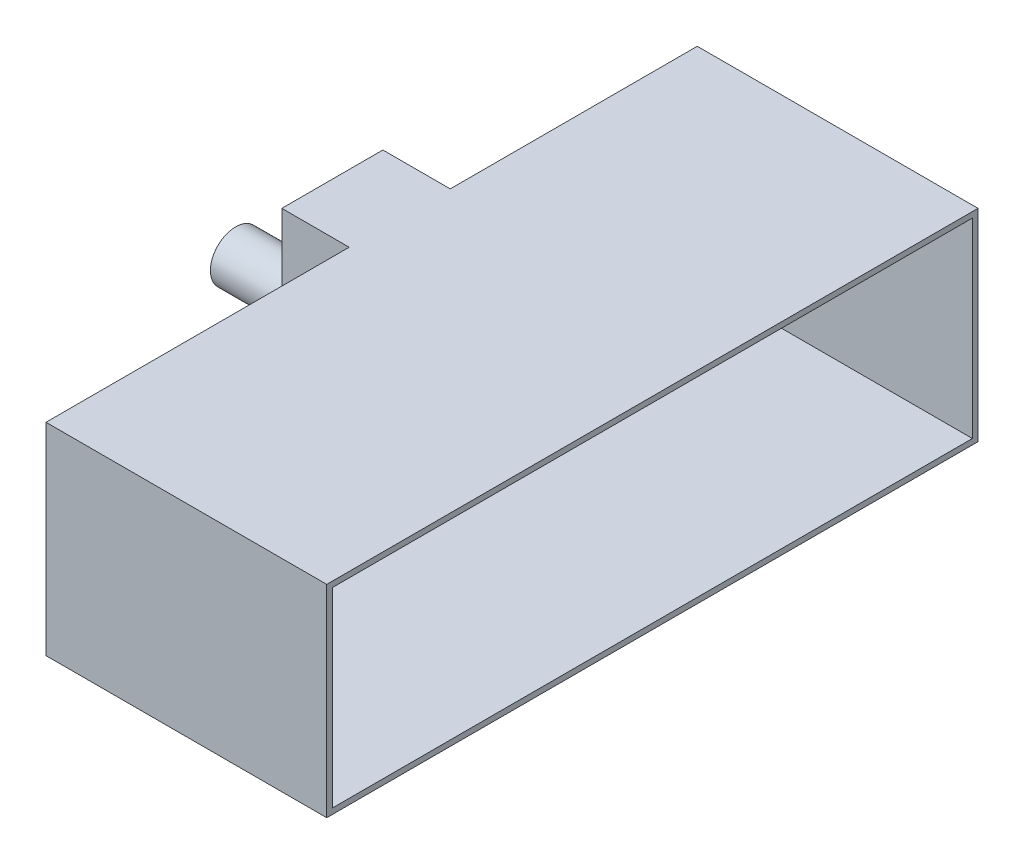
ISO-10303-21;
HEADER;
FILE_DESCRIPTION(('STEP AP214'),'2;1');
FILE_NAME('part.step','',(''),(''),'','','');
FILE_SCHEMA(('AUTOMOTIVE_DESIGN { 1 0 10303 214 1 1 1 1 }'));
ENDSEC;
DATA;
#1=APPLICATION_CONTEXT('core data for automotive mechanical design processes');
#2=APPLICATION_PROTOCOL_DEFINITION('international standard','automotive_design',2000,#1);
#3=PRODUCT_CONTEXT('',#1,'mechanical');
#4=PRODUCT('Part','Part','',(#3));
#5=PRODUCT_RELATED_PRODUCT_CATEGORY('part','',(#4));
#6=PRODUCT_DEFINITION_FORMATION('','',#4);
#7=PRODUCT_DEFINITION_CONTEXT('part definition',#1,'design');
#8=PRODUCT_DEFINITION('design','',#6,#7);
#9=PRODUCT_DEFINITION_SHAPE('','',#8);
#10=(LENGTH_UNIT() NAMED_UNIT(*) SI_UNIT(.MILLI.,.METRE.));
#11=(NAMED_UNIT(*) PLANE_ANGLE_UNIT() SI_UNIT($,.RADIAN.));
#12=(NAMED_UNIT(*) SI_UNIT($,.STERADIAN.) SOLID_ANGLE_UNIT());
#13=UNCERTAINTY_MEASURE_WITH_UNIT(LENGTH_MEASURE(1.E-05),#10,'distance_accuracy_value','');
#14=(GEOMETRIC_REPRESENTATION_CONTEXT(3) GLOBAL_UNCERTAINTY_ASSIGNED_CONTEXT((#13)) GLOBAL_UNIT_ASSIGNED_CONTEXT((#10,
#11,#12)) REPRESENTATION_CONTEXT('',''));
#15=CARTESIAN_POINT('',(0.,0.,0.));
#16=DIRECTION('',(0.,0.,1.));
#17=DIRECTION('',(1.,0.,0.));
#18=AXIS2_PLACEMENT_3D('',#15,#16,#17);
#19=CARTESIAN_POINT('',(96.7359625729888,0.,0.));
#20=DIRECTION('',(1.,0.,0.));
#21=DIRECTION('',(0.,0.,-1.));
#22=AXIS2_PLACEMENT_3D('',#19,#20,#21);
#23=PLANE('',#22);
#24=DIRECTION('',(0.,0.,1.));
#25=VECTOR('',#24,1.);
#26=CARTESIAN_POINT('',(96.7359625729888,31.5575186676009,0.));
#27=LINE('',#26,#25);
#28=CARTESIAN_POINT('',(96.7359625729888,31.5575186676009,70.5046734768405));
#29=VERTEX_POINT('',#28);
#30=CARTESIAN_POINT('',(96.7359625729888,31.5575186676009,97.5046734768405));
#31=VERTEX_POINT('',#30);
#32=EDGE_CURVE('E219',#29,#31,#27,.T.);
#33=ORIENTED_EDGE('',*,*,#32,.F.);
#34=DIRECTION('',(0.,1.,0.));
#35=VECTOR('',#34,1.);
#36=CARTESIAN_POINT('',(96.7359625729888,0.,70.5046734768405));
#37=LINE('',#36,#35);
#38=CARTESIAN_POINT('',(96.7359625729888,48.5575186676009,70.5046734768405));
#39=VERTEX_POINT('',#38);
#40=EDGE_CURVE('E222',#29,#39,#37,.T.);
#41=ORIENTED_EDGE('',*,*,#40,.T.);
#42=DIRECTION('',(0.,0.,1.));
#43=VECTOR('',#42,1.);
#44=CARTESIAN_POINT('',(96.7359625729888,48.5575186676009,0.));
#45=LINE('',#44,#43);
#46=CARTESIAN_POINT('',(96.7359625729888,48.5575186676009,97.5046734768405));
#47=VERTEX_POINT('',#46);
#48=EDGE_CURVE('E215',#39,#47,#45,.T.);
#49=ORIENTED_EDGE('',*,*,#48,.T.);
#50=DIRECTION('',(0.,1.,0.));
#51=VECTOR('',#50,1.);
#52=CARTESIAN_POINT('',(96.7359625729888,0.,97.5046734768405));
#53=LINE('',#52,#51);
#54=EDGE_CURVE('E12',#31,#47,#53,.T.);
#55=ORIENTED_EDGE('',*,*,#54,.F.);
#56=EDGE_LOOP('',(#33,#41,#49,#55));
#57=FACE_BOUND('',#56,.T.);
#58=ADVANCED_FACE('F47',(#57),#23,.T.);
#59=CARTESIAN_POINT('',(96.2359625729888,48.5575186676009,0.));
#60=DIRECTION('',(0.,1.,0.));
#61=DIRECTION('',(-1.,0.,0.));
#62=AXIS2_PLACEMENT_3D('',#59,#60,#61);
#63=PLANE('',#62);
#64=DIRECTION('',(-1.,0.,0.));
#65=VECTOR('',#64,1.);
#66=CARTESIAN_POINT('',(96.2359625729888,48.5575186676009,70.5046734768405));
#67=LINE('',#66,#65);
#68=CARTESIAN_POINT('',(90.7359625729888,48.5575186676009,70.5046734768405));
#69=VERTEX_POINT('',#68);
#70=EDGE_CURVE('E276',#39,#69,#67,.T.);
#71=ORIENTED_EDGE('',*,*,#70,.T.);
#72=DIRECTION('',(0.,0.,-1.));
#73=VECTOR('',#72,1.);
#74=CARTESIAN_POINT('',(90.7359625729888,48.5575186676009,0.));
#75=LINE('',#74,#73);
#76=CARTESIAN_POINT('',(90.7359625729888,48.5575186676009,62.5046734768405));
#77=VERTEX_POINT('',#76);
#78=EDGE_CURVE('E250',#69,#77,#75,.T.);
#79=ORIENTED_EDGE('',*,*,#78,.T.);
#80=DIRECTION('',(-1.,0.,0.));
#81=VECTOR('',#80,1.);
#82=CARTESIAN_POINT('',(96.2359625729888,48.5575186676009,62.5046734768405));
#83=LINE('',#82,#81);
#84=CARTESIAN_POINT('',(96.7359625729888,48.5575186676009,62.5046734768405));
#85=VERTEX_POINT('',#84);
#86=EDGE_CURVE('E55',#85,#77,#83,.T.);
#87=ORIENTED_EDGE('',*,*,#86,.F.);
#88=CARTESIAN_POINT('',(96.7359625729888,48.5575186676009,40.5046734768405));
#89=VERTEX_POINT('',#88);
#90=EDGE_CURVE('E218',#89,#85,#45,.T.);
#91=ORIENTED_EDGE('',*,*,#90,.F.);
#92=DIRECTION('',(-1.,0.,0.));
#93=VECTOR('',#92,1.);
#94=CARTESIAN_POINT('',(121.235962572989,48.5575186676009,40.5046734768405));
#95=LINE('',#94,#93);
#96=CARTESIAN_POINT('',(121.235962572989,48.5575186676009,40.5046734768405));
#97=VERTEX_POINT('',#96);
#98=EDGE_CURVE('E62',#97,#89,#95,.T.);
#99=ORIENTED_EDGE('',*,*,#98,.F.);
#100=DIRECTION('',(0.,0.,-1.));
#101=VECTOR('',#100,1.);
#102=CARTESIAN_POINT('',(121.235962572989,48.5575186676009,0.));
#103=LINE('',#102,#101);
#104=CARTESIAN_POINT('',(121.235962572989,48.5575186676009,97.5046734768405));
#105=VERTEX_POINT('',#104);
#106=EDGE_CURVE('E197',#105,#97,#103,.T.);
#107=ORIENTED_EDGE('',*,*,#106,.F.);
#108=DIRECTION('',(-1.,0.,0.));
#109=VECTOR('',#108,1.);
#110=CARTESIAN_POINT('',(121.235962572989,48.5575186676009,97.5046734768405));
#111=LINE('',#110,#109);
#112=EDGE_CURVE('E206',#105,#47,#111,.T.);
#113=ORIENTED_EDGE('',*,*,#112,.T.);
#114=ORIENTED_EDGE('',*,*,#48,.F.);
#115=EDGE_LOOP('',(#71,#79,#87,#91,#99,#107,#113,#114));
#116=FACE_BOUND('',#115,.T.);
#117=ADVANCED_FACE('F332',(#116),#63,.F.);
#118=CARTESIAN_POINT('',(96.2359625729888,0.,62.5046734768405));
#119=DIRECTION('',(0.,0.,-1.));
#120=DIRECTION('',(-1.,0.,0.));
#121=AXIS2_PLACEMENT_3D('',#118,#119,#120);
#122=PLANE('',#121);
#123=ORIENTED_EDGE('',*,*,#86,.T.);
#124=DIRECTION('',(0.,-1.,0.));
#125=VECTOR('',#124,1.);
#126=CARTESIAN_POINT('',(90.7359625729888,0.,62.5046734768405));
#127=LINE('',#126,#125);
#128=CARTESIAN_POINT('',(90.7359625729888,31.5575186676009,62.5046734768405));
#129=VERTEX_POINT('',#128);
#130=EDGE_CURVE('E248',#77,#129,#127,.T.);
#131=ORIENTED_EDGE('',*,*,#130,.T.);
#132=DIRECTION('',(-1.,0.,0.));
#133=VECTOR('',#132,1.);
#134=CARTESIAN_POINT('',(96.2359625729888,31.5575186676009,62.5046734768405));
#135=LINE('',#134,#133);
#136=CARTESIAN_POINT('',(96.7359625729888,31.5575186676009,62.5046734768405));
#137=VERTEX_POINT('',#136);
#138=EDGE_CURVE('E281',#137,#129,#135,.T.);
#139=ORIENTED_EDGE('',*,*,#138,.F.);
#140=DIRECTION('',(0.,-1.,0.));
#141=VECTOR('',#140,1.);
#142=CARTESIAN_POINT('',(96.7359625729888,0.,62.5046734768405));
#143=LINE('',#142,#141);
#144=EDGE_CURVE('E225',#85,#137,#143,.T.);
#145=ORIENTED_EDGE('',*,*,#144,.F.);
#146=EDGE_LOOP('',(#123,#131,#139,#145));
#147=FACE_BOUND('',#146,.T.);
#148=ADVANCED_FACE('F337',(#147),#122,.F.);
#149=CARTESIAN_POINT('',(96.2359625729888,31.5575186676009,0.));
#150=DIRECTION('',(0.,1.,0.));
#151=DIRECTION('',(-1.,0.,0.));
#152=AXIS2_PLACEMENT_3D('',#149,#150,#151);
#153=PLANE('',#152);
#154=ORIENTED_EDGE('',*,*,#138,.T.);
#155=DIRECTION('',(0.,0.,-1.));
#156=VECTOR('',#155,1.);
#157=CARTESIAN_POINT('',(90.7359625729888,31.5575186676009,0.));
#158=LINE('',#157,#156);
#159=CARTESIAN_POINT('',(90.7359625729888,31.5575186676009,70.5046734768405));
#160=VERTEX_POINT('',#159);
#161=EDGE_CURVE('E255',#160,#129,#158,.T.);
#162=ORIENTED_EDGE('',*,*,#161,.F.);
#163=DIRECTION('',(-1.,0.,0.));
#164=VECTOR('',#163,1.);
#165=CARTESIAN_POINT('',(96.2359625729888,31.5575186676009,70.5046734768405));
#166=LINE('',#165,#164);
#167=EDGE_CURVE('E278',#29,#160,#166,.T.);
#168=ORIENTED_EDGE('',*,*,#167,.F.);
#169=ORIENTED_EDGE('',*,*,#32,.T.);
#170=DIRECTION('',(-1.,0.,0.));
#171=VECTOR('',#170,1.);
#172=CARTESIAN_POINT('',(121.235962572989,31.5575186676009,97.5046734768405));
#173=LINE('',#172,#171);
#174=CARTESIAN_POINT('',(121.235962572989,31.5575186676009,97.5046734768405));
#175=VERTEX_POINT('',#174);
#176=EDGE_CURVE('E209',#175,#31,#173,.T.);
#177=ORIENTED_EDGE('',*,*,#176,.F.);
#178=DIRECTION('',(0.,0.,-1.));
#179=VECTOR('',#178,1.);
#180=CARTESIAN_POINT('',(121.235962572989,31.5575186676009,0.));
#181=LINE('',#180,#179);
#182=CARTESIAN_POINT('',(121.235962572989,31.5575186676009,40.5046734768405));
#183=VERTEX_POINT('',#182);
#184=EDGE_CURVE('E191',#175,#183,#181,.T.);
#185=ORIENTED_EDGE('',*,*,#184,.T.);
#186=DIRECTION('',(-1.,0.,0.));
#187=VECTOR('',#186,1.);
#188=CARTESIAN_POINT('',(121.235962572989,31.5575186676009,40.5046734768405));
#189=LINE('',#188,#187);
#190=CARTESIAN_POINT('',(96.7359625729888,31.5575186676009,40.5046734768405));
#191=VERTEX_POINT('',#190);
#192=EDGE_CURVE('E202',#183,#191,#189,.T.);
#193=ORIENTED_EDGE('',*,*,#192,.T.);
#194=EDGE_CURVE('E221',#191,#137,#27,.T.);
#195=ORIENTED_EDGE('',*,*,#194,.T.);
#196=EDGE_LOOP('',(#154,#162,#168,#169,#177,#185,#193,#195));
#197=FACE_BOUND('',#196,.T.);
#198=ADVANCED_FACE('F442',(#197),#153,.T.);
#199=CARTESIAN_POINT('',(96.2359625729888,0.,62.0046734768405));
#200=DIRECTION('',(0.,0.,-1.));
#201=DIRECTION('',(-1.,0.,0.));
#202=AXIS2_PLACEMENT_3D('',#199,#200,#201);
#203=PLANE('',#202);
#204=DIRECTION('',(0.,-1.,0.));
#205=VECTOR('',#204,1.);
#206=CARTESIAN_POINT('',(90.2359625729888,0.,62.0046734768405));
#207=LINE('',#206,#205);
#208=CARTESIAN_POINT('',(90.2359625729888,49.0575186676009,62.0046734768405));
#209=VERTEX_POINT('',#208);
#210=CARTESIAN_POINT('',(90.2359625729888,31.0575186676009,62.0046734768405));
#211=VERTEX_POINT('',#210);
#212=EDGE_CURVE('E258',#209,#211,#207,.T.);
#213=ORIENTED_EDGE('',*,*,#212,.F.);
#214=DIRECTION('',(-1.,0.,0.));
#215=VECTOR('',#214,1.);
#216=CARTESIAN_POINT('',(96.2359625729888,49.0575186676009,62.0046734768405));
#217=LINE('',#216,#215);
#218=CARTESIAN_POINT('',(96.2359625729888,49.0575186676009,62.0046734768405));
#219=VERTEX_POINT('',#218);
#220=EDGE_CURVE('E279',#219,#209,#217,.T.);
#221=ORIENTED_EDGE('',*,*,#220,.F.);
#222=DIRECTION('',(0.,-1.,0.));
#223=VECTOR('',#222,1.);
#224=CARTESIAN_POINT('',(96.2359625729888,0.,62.0046734768405));
#225=LINE('',#224,#223);
#226=CARTESIAN_POINT('',(96.2359625729888,31.0575186676009,62.0046734768405));
#227=VERTEX_POINT('',#226);
#228=EDGE_CURVE('E261',#219,#227,#225,.T.);
#229=ORIENTED_EDGE('',*,*,#228,.T.);
#230=DIRECTION('',(-1.,0.,0.));
#231=VECTOR('',#230,1.);
#232=CARTESIAN_POINT('',(96.2359625729888,31.0575186676009,62.0046734768405));
#233=LINE('',#232,#231);
#234=EDGE_CURVE('E266',#227,#211,#233,.T.);
#235=ORIENTED_EDGE('',*,*,#234,.T.);
#236=EDGE_LOOP('',(#213,#221,#229,#235));
#237=FACE_BOUND('',#236,.T.);
#238=ADVANCED_FACE('F49',(#237),#203,.T.);
#239=CARTESIAN_POINT('',(96.2359625729888,49.0575186676009,0.));
#240=DIRECTION('',(0.,1.,0.));
#241=DIRECTION('',(-1.,0.,0.));
#242=AXIS2_PLACEMENT_3D('',#239,#240,#241);
#243=PLANE('',#242);
#244=DIRECTION('',(0.,0.,-1.));
#245=VECTOR('',#244,1.);
#246=CARTESIAN_POINT('',(96.2359625729888,49.0575186676009,0.));
#247=LINE('',#246,#245);
#248=CARTESIAN_POINT('',(96.2359625729888,49.0575186676009,40.0046734768405));
#249=VERTEX_POINT('',#248);
#250=EDGE_CURVE('E232',#219,#249,#247,.T.);
#251=ORIENTED_EDGE('',*,*,#250,.F.);
#252=ORIENTED_EDGE('',*,*,#220,.T.);
#253=DIRECTION('',(0.,0.,-1.));
#254=VECTOR('',#253,1.);
#255=CARTESIAN_POINT('',(90.2359625729888,49.0575186676009,0.));
#256=LINE('',#255,#254);
#257=CARTESIAN_POINT('',(90.2359625729888,49.0575186676009,71.0046734768405));
#258=VERTEX_POINT('',#257);
#259=EDGE_CURVE('E269',#258,#209,#256,.T.);
#260=ORIENTED_EDGE('',*,*,#259,.F.);
#261=DIRECTION('',(-1.,0.,0.));
#262=VECTOR('',#261,1.);
#263=CARTESIAN_POINT('',(96.2359625729888,49.0575186676009,71.0046734768405));
#264=LINE('',#263,#262);
#265=CARTESIAN_POINT('',(96.2359625729888,49.0575186676009,71.0046734768405));
#266=VERTEX_POINT('',#265);
#267=EDGE_CURVE('E288',#266,#258,#264,.T.);
#268=ORIENTED_EDGE('',*,*,#267,.F.);
#269=CARTESIAN_POINT('',(96.2359625729888,49.0575186676009,98.0046734768405));
#270=VERTEX_POINT('',#269);
#271=EDGE_CURVE('E233',#270,#266,#247,.T.);
#272=ORIENTED_EDGE('',*,*,#271,.F.);
#273=DIRECTION('',(-1.,0.,0.));
#274=VECTOR('',#273,1.);
#275=CARTESIAN_POINT('',(96.7359625729888,49.0575186676009,98.0046734768405));
#276=LINE('',#275,#274);
#277=CARTESIAN_POINT('',(121.235962572989,49.0575186676009,98.0046734768405));
#278=VERTEX_POINT('',#277);
#279=EDGE_CURVE('E170',#278,#270,#276,.T.);
#280=ORIENTED_EDGE('',*,*,#279,.F.);
#281=DIRECTION('',(0.,0.,1.));
#282=VECTOR('',#281,1.);
#283=CARTESIAN_POINT('',(121.235962572989,49.0575186676009,0.));
#284=LINE('',#283,#282);
#285=CARTESIAN_POINT('',(121.235962572989,49.0575186676009,40.0046734768405));
#286=VERTEX_POINT('',#285);
#287=EDGE_CURVE('E186',#286,#278,#284,.T.);
#288=ORIENTED_EDGE('',*,*,#287,.F.);
#289=DIRECTION('',(-1.,0.,0.));
#290=VECTOR('',#289,1.);
#291=CARTESIAN_POINT('',(96.7359625729888,49.0575186676009,40.0046734768405));
#292=LINE('',#291,#290);
#293=EDGE_CURVE('E241',#286,#249,#292,.T.);
#294=ORIENTED_EDGE('',*,*,#293,.T.);
#295=EDGE_LOOP('',(#251,#252,#260,#268,#272,#280,#288,#294));
#296=FACE_BOUND('',#295,.T.);
#297=ADVANCED_FACE('F293',(#296),#243,.T.);
#298=CARTESIAN_POINT('',(96.2359625729888,0.,71.0046734768405));
#299=DIRECTION('',(0.,0.,-1.));
#300=DIRECTION('',(-1.,0.,0.));
#301=AXIS2_PLACEMENT_3D('',#298,#299,#300);
#302=PLANE('',#301);
#303=DIRECTION('',(0.,-1.,0.));
#304=VECTOR('',#303,1.);
#305=CARTESIAN_POINT('',(90.2359625729888,0.,71.0046734768405));
#306=LINE('',#305,#304);
#307=CARTESIAN_POINT('',(90.2359625729888,31.0575186676009,71.0046734768405));
#308=VERTEX_POINT('',#307);
#309=EDGE_CURVE('E272',#258,#308,#306,.T.);
#310=ORIENTED_EDGE('',*,*,#309,.T.);
#311=DIRECTION('',(-1.,0.,0.));
#312=VECTOR('',#311,1.);
#313=CARTESIAN_POINT('',(96.2359625729888,31.0575186676009,71.0046734768405));
#314=LINE('',#313,#312);
#315=CARTESIAN_POINT('',(96.2359625729888,31.0575186676009,71.0046734768405));
#316=VERTEX_POINT('',#315);
#317=EDGE_CURVE('E285',#316,#308,#314,.T.);
#318=ORIENTED_EDGE('',*,*,#317,.F.);
#319=DIRECTION('',(0.,-1.,0.));
#320=VECTOR('',#319,1.);
#321=CARTESIAN_POINT('',(96.2359625729888,0.,71.0046734768405));
#322=LINE('',#321,#320);
#323=EDGE_CURVE('E263',#266,#316,#322,.T.);
#324=ORIENTED_EDGE('',*,*,#323,.F.);
#325=ORIENTED_EDGE('',*,*,#267,.T.);
#326=EDGE_LOOP('',(#310,#318,#324,#325));
#327=FACE_BOUND('',#326,.T.);
#328=ADVANCED_FACE('F304',(#327),#302,.F.);
#329=CARTESIAN_POINT('',(96.2359625729888,31.0575186676009,0.));
#330=DIRECTION('',(0.,1.,0.));
#331=DIRECTION('',(-1.,0.,0.));
#332=AXIS2_PLACEMENT_3D('',#329,#330,#331);
#333=PLANE('',#332);
#334=DIRECTION('',(0.,0.,-1.));
#335=VECTOR('',#334,1.);
#336=CARTESIAN_POINT('',(96.2359625729888,31.0575186676009,0.));
#337=LINE('',#336,#335);
#338=CARTESIAN_POINT('',(96.2359625729888,31.0575186676009,98.0046734768405));
#339=VERTEX_POINT('',#338);
#340=EDGE_CURVE('E226',#339,#316,#337,.T.);
#341=ORIENTED_EDGE('',*,*,#340,.T.);
#342=ORIENTED_EDGE('',*,*,#317,.T.);
#343=DIRECTION('',(0.,0.,-1.));
#344=VECTOR('',#343,1.);
#345=CARTESIAN_POINT('',(90.2359625729888,31.0575186676009,0.));
#346=LINE('',#345,#344);
#347=EDGE_CURVE('E264',#308,#211,#346,.T.);
#348=ORIENTED_EDGE('',*,*,#347,.T.);
#349=ORIENTED_EDGE('',*,*,#234,.F.);
#350=CARTESIAN_POINT('',(96.2359625729888,31.0575186676009,40.0046734768405));
#351=VERTEX_POINT('',#350);
#352=EDGE_CURVE('E237',#227,#351,#337,.T.);
#353=ORIENTED_EDGE('',*,*,#352,.T.);
#354=DIRECTION('',(-1.,0.,0.));
#355=VECTOR('',#354,1.);
#356=CARTESIAN_POINT('',(96.7359625729888,31.0575186676009,40.0046734768405));
#357=LINE('',#356,#355);
#358=CARTESIAN_POINT('',(121.235962572989,31.0575186676009,40.0046734768405));
#359=VERTEX_POINT('',#358);
#360=EDGE_CURVE('E171',#359,#351,#357,.T.);
#361=ORIENTED_EDGE('',*,*,#360,.F.);
#362=DIRECTION('',(0.,0.,-1.));
#363=VECTOR('',#362,1.);
#364=CARTESIAN_POINT('',(121.235962572989,31.0575186676009,0.));
#365=LINE('',#364,#363);
#366=CARTESIAN_POINT('',(121.235962572989,31.0575186676009,98.0046734768405));
#367=VERTEX_POINT('',#366);
#368=EDGE_CURVE('E174',#367,#359,#365,.T.);
#369=ORIENTED_EDGE('',*,*,#368,.F.);
#370=DIRECTION('',(-1.,0.,0.));
#371=VECTOR('',#370,1.);
#372=CARTESIAN_POINT('',(96.7359625729888,31.0575186676009,98.0046734768405));
#373=LINE('',#372,#371);
#374=EDGE_CURVE('E161',#367,#339,#373,.T.);
#375=ORIENTED_EDGE('',*,*,#374,.T.);
#376=EDGE_LOOP('',(#341,#342,#348,#349,#353,#361,#369,#375));
#377=FACE_BOUND('',#376,.T.);
#378=ADVANCED_FACE('F175',(#377),#333,.F.);
#379=CARTESIAN_POINT('',(96.2359625729888,0.,70.5046734768405));
#380=DIRECTION('',(0.,0.,-1.));
#381=DIRECTION('',(-1.,0.,0.));
#382=AXIS2_PLACEMENT_3D('',#379,#380,#381);
#383=PLANE('',#382);
#384=DIRECTION('',(0.,-1.,0.));
#385=VECTOR('',#384,1.);
#386=CARTESIAN_POINT('',(90.7359625729888,0.,70.5046734768405));
#387=LINE('',#386,#385);
#388=EDGE_CURVE('E252',#69,#160,#387,.T.);
#389=ORIENTED_EDGE('',*,*,#388,.F.);
#390=ORIENTED_EDGE('',*,*,#70,.F.);
#391=ORIENTED_EDGE('',*,*,#40,.F.);
#392=ORIENTED_EDGE('',*,*,#167,.T.);
#393=EDGE_LOOP('',(#389,#390,#391,#392));
#394=FACE_BOUND('',#393,.T.);
#395=ADVANCED_FACE('F399',(#394),#383,.T.);
#396=CARTESIAN_POINT('',(90.2359625729888,0.,0.));
#397=DIRECTION('',(1.,0.,0.));
#398=DIRECTION('',(0.,0.,-1.));
#399=AXIS2_PLACEMENT_3D('',#396,#397,#398);
#400=PLANE('',#399);
#401=ORIENTED_EDGE('',*,*,#212,.T.);
#402=ORIENTED_EDGE('',*,*,#347,.F.);
#403=ORIENTED_EDGE('',*,*,#309,.F.);
#404=ORIENTED_EDGE('',*,*,#259,.T.);
#405=EDGE_LOOP('',(#401,#402,#403,#404));
#406=FACE_BOUND('',#405,.T.);
#407=CARTESIAN_POINT('',(90.2359625729888,39.2010313263827,66.8796734768382));
#408=DIRECTION('',(1.,0.,0.));
#409=DIRECTION('',(0.,0.,-1.));
#410=AXIS2_PLACEMENT_3D('',#407,#408,#409);
#411=CIRCLE('',#410,1.75);
#412=CARTESIAN_POINT('',(90.2359625729888,39.2010313263827,65.1296734768382));
#413=VERTEX_POINT('',#412);
#414=EDGE_CURVE('E244',#413,#413,#411,.T.);
#415=ORIENTED_EDGE('',*,*,#414,.T.);
#416=EDGE_LOOP('',(#415));
#417=FACE_BOUND('',#416,.T.);
#418=ADVANCED_FACE('F300',(#406,#417),#400,.F.);
#419=CARTESIAN_POINT('',(90.7359625729888,39.2010313263827,66.8796734768382));
#420=DIRECTION('',(-1.,0.,0.));
#421=DIRECTION('',(0.,0.,1.));
#422=AXIS2_PLACEMENT_3D('',#419,#420,#421);
#423=CYLINDRICAL_SURFACE('',#422,1.75);
#424=CARTESIAN_POINT('',(90.7359625729888,39.2010313263827,66.8796734768382));
#425=DIRECTION('',(1.,0.,0.));
#426=DIRECTION('',(0.,0.,-1.));
#427=AXIS2_PLACEMENT_3D('',#424,#425,#426);
#428=CIRCLE('',#427,1.75);
#429=CARTESIAN_POINT('',(90.7359625729888,39.2010313263827,65.1296734768382));
#430=VERTEX_POINT('',#429);
#431=EDGE_CURVE('E245',#430,#430,#428,.T.);
#432=ORIENTED_EDGE('',*,*,#431,.T.);
#433=EDGE_LOOP('',(#432));
#434=FACE_BOUND('',#433,.T.);
#435=ORIENTED_EDGE('',*,*,#414,.F.);
#436=EDGE_LOOP('',(#435));
#437=FACE_BOUND('',#436,.T.);
#438=ADVANCED_FACE('F484',(#434,#437),#423,.F.);
#439=CARTESIAN_POINT('',(90.7359625729888,0.,0.));
#440=DIRECTION('',(1.,0.,0.));
#441=DIRECTION('',(0.,0.,-1.));
#442=AXIS2_PLACEMENT_3D('',#439,#440,#441);
#443=PLANE('',#442);
#444=ORIENTED_EDGE('',*,*,#431,.F.);
#445=EDGE_LOOP('',(#444));
#446=FACE_BOUND('',#445,.T.);
#447=ORIENTED_EDGE('',*,*,#130,.F.);
#448=ORIENTED_EDGE('',*,*,#78,.F.);
#449=ORIENTED_EDGE('',*,*,#388,.T.);
#450=ORIENTED_EDGE('',*,*,#161,.T.);
#451=EDGE_LOOP('',(#447,#448,#449,#450));
#452=FACE_BOUND('',#451,.T.);
#453=ADVANCED_FACE('F330',(#446,#452),#443,.T.);
#454=CARTESIAN_POINT('',(96.2359625729888,0.,0.));
#455=DIRECTION('',(1.,0.,0.));
#456=DIRECTION('',(0.,0.,-1.));
#457=AXIS2_PLACEMENT_3D('',#454,#455,#456);
#458=PLANE('',#457);
#459=ORIENTED_EDGE('',*,*,#323,.T.);
#460=ORIENTED_EDGE('',*,*,#340,.F.);
#461=DIRECTION('',(0.,-1.,0.));
#462=VECTOR('',#461,1.);
#463=CARTESIAN_POINT('',(96.2359625729888,0.,98.0046734768405));
#464=LINE('',#463,#462);
#465=EDGE_CURVE('E167',#270,#339,#464,.T.);
#466=ORIENTED_EDGE('',*,*,#465,.F.);
#467=ORIENTED_EDGE('',*,*,#271,.T.);
#468=EDGE_LOOP('',(#459,#460,#466,#467));
#469=FACE_BOUND('',#468,.T.);
#470=ADVANCED_FACE('F307',(#469),#458,.F.);
#471=CARTESIAN_POINT('',(96.7359625729888,0.,40.0046734768405));
#472=DIRECTION('',(0.,0.,-1.));
#473=DIRECTION('',(-1.,0.,0.));
#474=AXIS2_PLACEMENT_3D('',#471,#472,#473);
#475=PLANE('',#474);
#476=DIRECTION('',(0.,-1.,0.));
#477=VECTOR('',#476,1.);
#478=CARTESIAN_POINT('',(96.2359625729888,0.,40.0046734768405));
#479=LINE('',#478,#477);
#480=EDGE_CURVE('E229',#249,#351,#479,.T.);
#481=ORIENTED_EDGE('',*,*,#480,.F.);
#482=ORIENTED_EDGE('',*,*,#293,.F.);
#483=DIRECTION('',(0.,-1.,0.));
#484=VECTOR('',#483,1.);
#485=CARTESIAN_POINT('',(121.235962572989,0.,40.0046734768405));
#486=LINE('',#485,#484);
#487=EDGE_CURVE('E180',#286,#359,#486,.T.);
#488=ORIENTED_EDGE('',*,*,#487,.T.);
#489=ORIENTED_EDGE('',*,*,#360,.T.);
#490=EDGE_LOOP('',(#481,#482,#488,#489));
#491=FACE_BOUND('',#490,.T.);
#492=ADVANCED_FACE('F311',(#491),#475,.T.);
#493=CARTESIAN_POINT('',(96.7359625729888,0.,98.0046734768405));
#494=DIRECTION('',(0.,0.,-1.));
#495=DIRECTION('',(0.,1.,0.));
#496=AXIS2_PLACEMENT_3D('',#493,#494,#495);
#497=PLANE('',#496);
#498=ORIENTED_EDGE('',*,*,#465,.T.);
#499=ORIENTED_EDGE('',*,*,#374,.F.);
#500=DIRECTION('',(0.,-1.,0.));
#501=VECTOR('',#500,1.);
#502=CARTESIAN_POINT('',(121.235962572989,0.,98.0046734768405));
#503=LINE('',#502,#501);
#504=EDGE_CURVE('E165',#278,#367,#503,.T.);
#505=ORIENTED_EDGE('',*,*,#504,.F.);
#506=ORIENTED_EDGE('',*,*,#279,.T.);
#507=EDGE_LOOP('',(#498,#499,#505,#506));
#508=FACE_BOUND('',#507,.T.);
#509=ADVANCED_FACE('F163',(#508),#497,.F.);
#510=ORIENTED_EDGE('',*,*,#194,.F.);
#511=DIRECTION('',(0.,1.,0.));
#512=VECTOR('',#511,1.);
#513=CARTESIAN_POINT('',(96.7359625729888,0.,40.5046734768405));
#514=LINE('',#513,#512);
#515=EDGE_CURVE('E212',#191,#89,#514,.T.);
#516=ORIENTED_EDGE('',*,*,#515,.T.);
#517=ORIENTED_EDGE('',*,*,#90,.T.);
#518=ORIENTED_EDGE('',*,*,#144,.T.);
#519=EDGE_LOOP('',(#510,#516,#517,#518));
#520=FACE_BOUND('',#519,.T.);
#521=ADVANCED_FACE('F317',(#520),#23,.T.);
#522=ORIENTED_EDGE('',*,*,#352,.F.);
#523=ORIENTED_EDGE('',*,*,#228,.F.);
#524=ORIENTED_EDGE('',*,*,#250,.T.);
#525=ORIENTED_EDGE('',*,*,#480,.T.);
#526=EDGE_LOOP('',(#522,#523,#524,#525));
#527=FACE_BOUND('',#526,.T.);
#528=ADVANCED_FACE('F314',(#527),#458,.F.);
#529=CARTESIAN_POINT('',(121.235962572989,0.,97.5046734768405));
#530=DIRECTION('',(0.,0.,-1.));
#531=DIRECTION('',(-1.,0.,0.));
#532=AXIS2_PLACEMENT_3D('',#529,#530,#531);
#533=PLANE('',#532);
#534=ORIENTED_EDGE('',*,*,#176,.T.);
#535=ORIENTED_EDGE('',*,*,#54,.T.);
#536=ORIENTED_EDGE('',*,*,#112,.F.);
#537=DIRECTION('',(0.,-1.,0.));
#538=VECTOR('',#537,1.);
#539=CARTESIAN_POINT('',(121.235962572989,0.,97.5046734768405));
#540=LINE('',#539,#538);
#541=EDGE_CURVE('E194',#105,#175,#540,.T.);
#542=ORIENTED_EDGE('',*,*,#541,.T.);
#543=EDGE_LOOP('',(#534,#535,#536,#542));
#544=FACE_BOUND('',#543,.T.);
#545=ADVANCED_FACE('F316',(#544),#533,.T.);
#546=CARTESIAN_POINT('',(121.235962572989,0.,40.5046734768405));
#547=DIRECTION('',(0.,0.,-1.));
#548=DIRECTION('',(-1.,0.,0.));
#549=AXIS2_PLACEMENT_3D('',#546,#547,#548);
#550=PLANE('',#549);
#551=ORIENTED_EDGE('',*,*,#515,.F.);
#552=ORIENTED_EDGE('',*,*,#192,.F.);
#553=DIRECTION('',(0.,-1.,0.));
#554=VECTOR('',#553,1.);
#555=CARTESIAN_POINT('',(121.235962572989,0.,40.5046734768405));
#556=LINE('',#555,#554);
#557=EDGE_CURVE('E200',#97,#183,#556,.T.);
#558=ORIENTED_EDGE('',*,*,#557,.F.);
#559=ORIENTED_EDGE('',*,*,#98,.T.);
#560=EDGE_LOOP('',(#551,#552,#558,#559));
#561=FACE_BOUND('',#560,.T.);
#562=ADVANCED_FACE('F323',(#561),#550,.F.);
#563=CARTESIAN_POINT('',(121.235962572989,0.,0.));
#564=DIRECTION('',(1.,0.,0.));
#565=DIRECTION('',(0.,0.,-1.));
#566=AXIS2_PLACEMENT_3D('',#563,#564,#565);
#567=PLANE('',#566);
#568=ORIENTED_EDGE('',*,*,#504,.T.);
#569=ORIENTED_EDGE('',*,*,#368,.T.);
#570=ORIENTED_EDGE('',*,*,#487,.F.);
#571=ORIENTED_EDGE('',*,*,#287,.T.);
#572=EDGE_LOOP('',(#568,#569,#570,#571));
#573=FACE_BOUND('',#572,.T.);
#574=ORIENTED_EDGE('',*,*,#184,.F.);
#575=ORIENTED_EDGE('',*,*,#541,.F.);
#576=ORIENTED_EDGE('',*,*,#106,.T.);
#577=ORIENTED_EDGE('',*,*,#557,.T.);
#578=EDGE_LOOP('',(#574,#575,#576,#577));
#579=FACE_BOUND('',#578,.T.);
#580=ADVANCED_FACE('F183',(#573,#579),#567,.T.);
#581=CLOSED_SHELL('',(#58,#117,#148,#198,#238,#297,#328,#378,#395,#418,#438,#453,#470,#492,#509,
#521,#528,#545,#562,#580));
#582=MANIFOLD_SOLID_BREP('B2',#581);
#583=CARTESIAN_POINT('',(96.5999236036678,39.2010313263827,66.8796734768382));
#584=DIRECTION('',(-1.,0.,0.));
#585=DIRECTION('',(0.,0.,1.));
#586=AXIS2_PLACEMENT_3D('',#583,#584,#585);
#587=CYLINDRICAL_SURFACE('',#586,2.25);
#588=CARTESIAN_POINT('',(82.,39.2010313263827,66.8796734768382));
#589=DIRECTION('',(1.,0.,0.));
#590=DIRECTION('',(0.,0.,-1.));
#591=AXIS2_PLACEMENT_3D('',#588,#589,#590);
#592=CIRCLE('',#591,2.25);
#593=CARTESIAN_POINT('',(82.,39.2010313263827,64.6296734768382));
#594=VERTEX_POINT('',#593);
#595=EDGE_CURVE('E666',#594,#594,#592,.T.);
#596=ORIENTED_EDGE('',*,*,#595,.T.);
#597=EDGE_LOOP('',(#596));
#598=FACE_BOUND('',#597,.T.);
#599=CARTESIAN_POINT('',(90.2359625729888,39.2010313263827,66.8796734768382));
#600=DIRECTION('',(1.,0.,0.));
#601=DIRECTION('',(0.,0.,-1.));
#602=AXIS2_PLACEMENT_3D('',#599,#600,#601);
#603=CIRCLE('',#602,2.25);
#604=CARTESIAN_POINT('',(90.2359625729888,39.2010313263827,64.6296734768382));
#605=VERTEX_POINT('',#604);
#606=EDGE_CURVE('E46',#605,#605,#603,.T.);
#607=ORIENTED_EDGE('',*,*,#606,.F.);
#608=EDGE_LOOP('',(#607));
#609=FACE_BOUND('',#608,.T.);
#610=ADVANCED_FACE('F659',(#598,#609),#587,.T.);
#611=CARTESIAN_POINT('',(82.,39.2010313263827,66.8796734768382));
#612=DIRECTION('',(1.,0.,0.));
#613=DIRECTION('',(0.,0.,-1.));
#614=AXIS2_PLACEMENT_3D('',#611,#612,#613);
#615=PLANE('',#614);
#616=ORIENTED_EDGE('',*,*,#595,.F.);
#617=EDGE_LOOP('',(#616));
#618=FACE_BOUND('',#617,.T.);
#619=CARTESIAN_POINT('',(82.,39.2010313263827,66.8796734768382));
#620=DIRECTION('',(1.,0.,0.));
#621=DIRECTION('',(0.,0.,-1.));
#622=AXIS2_PLACEMENT_3D('',#619,#620,#621);
#623=CIRCLE('',#622,1.75);
#624=CARTESIAN_POINT('',(82.,39.2010313263827,65.1296734768382));
#625=VERTEX_POINT('',#624);
#626=EDGE_CURVE('E671',#625,#625,#623,.T.);
#627=ORIENTED_EDGE('',*,*,#626,.T.);
#628=EDGE_LOOP('',(#627));
#629=FACE_BOUND('',#628,.T.);
#630=ADVANCED_FACE('F687',(#618,#629),#615,.F.);
#631=CARTESIAN_POINT('',(96.5999236036678,39.2010313263827,66.8796734768382));
#632=DIRECTION('',(-1.,0.,0.));
#633=DIRECTION('',(0.,0.,1.));
#634=AXIS2_PLACEMENT_3D('',#631,#632,#633);
#635=CYLINDRICAL_SURFACE('',#634,1.75);
#636=ORIENTED_EDGE('',*,*,#626,.F.);
#637=EDGE_LOOP('',(#636));
#638=FACE_BOUND('',#637,.T.);
#639=CARTESIAN_POINT('',(90.2359625729888,39.2010313263827,66.8796734768382));
#640=DIRECTION('',(1.,0.,0.));
#641=DIRECTION('',(0.,0.,-1.));
#642=AXIS2_PLACEMENT_3D('',#639,#640,#641);
#643=CIRCLE('',#642,1.75);
#644=CARTESIAN_POINT('',(90.2359625729888,39.2010313263827,65.1296734768382));
#645=VERTEX_POINT('',#644);
#646=EDGE_CURVE('E662',#645,#645,#643,.T.);
#647=ORIENTED_EDGE('',*,*,#646,.T.);
#648=EDGE_LOOP('',(#647));
#649=FACE_BOUND('',#648,.T.);
#650=ADVANCED_FACE('F679',(#638,#649),#635,.F.);
#651=CARTESIAN_POINT('',(90.2359625729888,0.,0.));
#652=DIRECTION('',(1.,0.,0.));
#653=DIRECTION('',(0.,0.,-1.));
#654=AXIS2_PLACEMENT_3D('',#651,#652,#653);
#655=PLANE('',#654);
#656=ORIENTED_EDGE('',*,*,#646,.F.);
#657=EDGE_LOOP('',(#656));
#658=FACE_BOUND('',#657,.T.);
#659=ORIENTED_EDGE('',*,*,#606,.T.);
#660=EDGE_LOOP('',(#659));
#661=FACE_BOUND('',#660,.T.);
#662=ADVANCED_FACE('F681',(#658,#661),#655,.T.);
#663=CLOSED_SHELL('',(#610,#630,#650,#662));
#664=MANIFOLD_SOLID_BREP('B6',#663);
#665=ADVANCED_BREP_SHAPE_REPRESENTATION('',(#18,#582,#664),#14);
#666=SHAPE_DEFINITION_REPRESENTATION(#9,#665);
ENDSEC;
END-ISO-10303-21;
